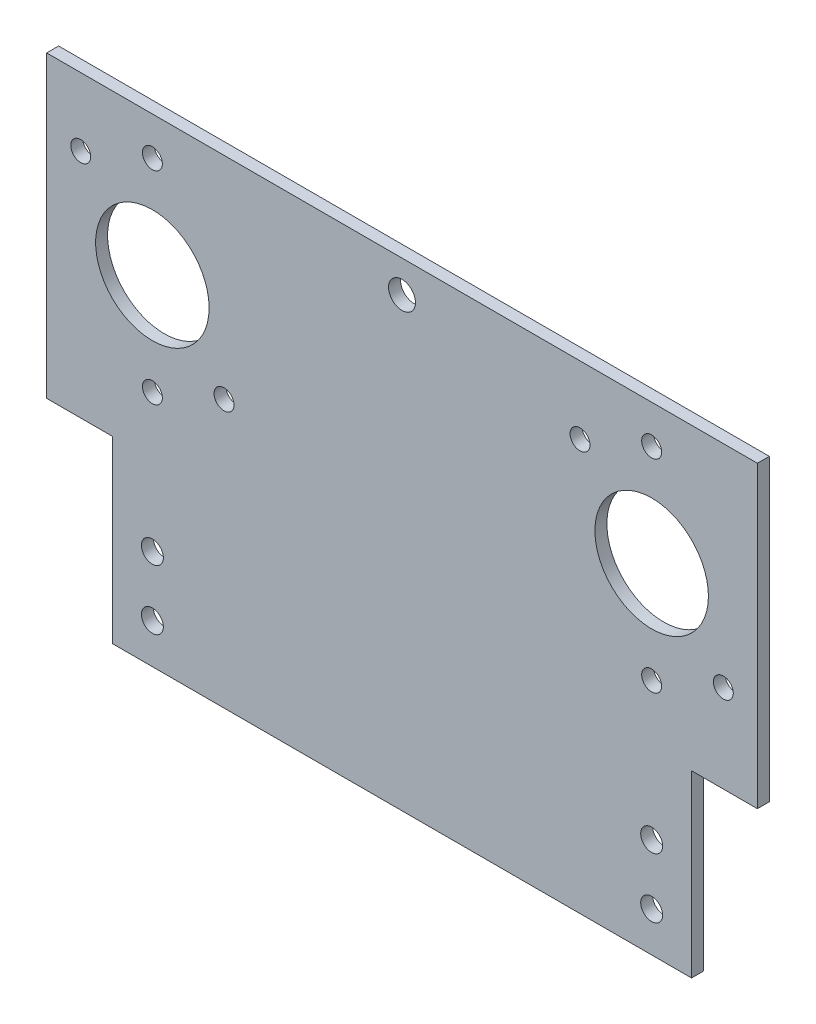
ISO-10303-21;
HEADER;
FILE_DESCRIPTION(('STEP AP214'),'2;1');
FILE_NAME('part.step','',(''),(''),'','','');
FILE_SCHEMA(('AUTOMOTIVE_DESIGN { 1 0 10303 214 1 1 1 1 }'));
ENDSEC;
DATA;
#1=APPLICATION_CONTEXT('core data for automotive mechanical design processes');
#2=APPLICATION_PROTOCOL_DEFINITION('international standard','automotive_design',2000,#1);
#3=PRODUCT_CONTEXT('',#1,'mechanical');
#4=PRODUCT('Part','Part','',(#3));
#5=PRODUCT_RELATED_PRODUCT_CATEGORY('part','',(#4));
#6=PRODUCT_DEFINITION_FORMATION('','',#4);
#7=PRODUCT_DEFINITION_CONTEXT('part definition',#1,'design');
#8=PRODUCT_DEFINITION('design','',#6,#7);
#9=PRODUCT_DEFINITION_SHAPE('','',#8);
#10=(LENGTH_UNIT() NAMED_UNIT(*) SI_UNIT(.MILLI.,.METRE.));
#11=(NAMED_UNIT(*) PLANE_ANGLE_UNIT() SI_UNIT($,.RADIAN.));
#12=(NAMED_UNIT(*) SI_UNIT($,.STERADIAN.) SOLID_ANGLE_UNIT());
#13=UNCERTAINTY_MEASURE_WITH_UNIT(LENGTH_MEASURE(1.E-05),#10,'distance_accuracy_value','');
#14=(GEOMETRIC_REPRESENTATION_CONTEXT(3) GLOBAL_UNCERTAINTY_ASSIGNED_CONTEXT((#13)) GLOBAL_UNIT_ASSIGNED_CONTEXT((#10,
#11,#12)) REPRESENTATION_CONTEXT('',''));
#15=CARTESIAN_POINT('',(0.,0.,0.));
#16=DIRECTION('',(0.,0.,1.));
#17=DIRECTION('',(1.,0.,0.));
#18=AXIS2_PLACEMENT_3D('',#15,#16,#17);
#19=CARTESIAN_POINT('',(0.,-120.,3.));
#20=DIRECTION('',(0.,1.,0.));
#21=DIRECTION('',(0.,0.,1.));
#22=AXIS2_PLACEMENT_3D('',#19,#20,#21);
#23=PLANE('',#22);
#24=DIRECTION('',(1.,0.,0.));
#25=VECTOR('',#24,1.);
#26=CARTESIAN_POINT('',(0.,-120.,0.));
#27=LINE('',#26,#25);
#28=CARTESIAN_POINT('',(16.5,-120.,0.));
#29=VERTEX_POINT('',#28);
#30=CARTESIAN_POINT('',(161.66,-120.,0.));
#31=VERTEX_POINT('',#30);
#32=EDGE_CURVE('E123',#29,#31,#27,.T.);
#33=ORIENTED_EDGE('',*,*,#32,.T.);
#34=DIRECTION('',(0.,0.,1.));
#35=VECTOR('',#34,1.);
#36=CARTESIAN_POINT('',(161.66,-120.,0.));
#37=LINE('',#36,#35);
#38=CARTESIAN_POINT('',(161.66,-120.,3.));
#39=VERTEX_POINT('',#38);
#40=EDGE_CURVE('E172',#31,#39,#37,.T.);
#41=ORIENTED_EDGE('',*,*,#40,.T.);
#42=DIRECTION('',(1.,0.,0.));
#43=VECTOR('',#42,1.);
#44=CARTESIAN_POINT('',(0.,-120.,3.));
#45=LINE('',#44,#43);
#46=CARTESIAN_POINT('',(16.5,-120.,3.));
#47=VERTEX_POINT('',#46);
#48=EDGE_CURVE('E141',#47,#39,#45,.T.);
#49=ORIENTED_EDGE('',*,*,#48,.F.);
#50=DIRECTION('',(0.,0.,1.));
#51=VECTOR('',#50,1.);
#52=CARTESIAN_POINT('',(16.5,-120.,0.));
#53=LINE('',#52,#51);
#54=EDGE_CURVE('E175',#29,#47,#53,.T.);
#55=ORIENTED_EDGE('',*,*,#54,.F.);
#56=EDGE_LOOP('',(#33,#41,#49,#55));
#57=FACE_BOUND('',#56,.T.);
#58=ADVANCED_FACE('F39',(#57),#23,.F.);
#59=CARTESIAN_POINT('',(178.16,0.,3.));
#60=DIRECTION('',(-1.,0.,0.));
#61=DIRECTION('',(0.,-1.,0.));
#62=AXIS2_PLACEMENT_3D('',#59,#60,#61);
#63=PLANE('',#62);
#64=DIRECTION('',(0.,0.,1.));
#65=VECTOR('',#64,1.);
#66=CARTESIAN_POINT('',(178.16,-75.,0.));
#67=LINE('',#66,#65);
#68=CARTESIAN_POINT('',(178.16,-75.,0.));
#69=VERTEX_POINT('',#68);
#70=CARTESIAN_POINT('',(178.16,-75.,3.));
#71=VERTEX_POINT('',#70);
#72=EDGE_CURVE('E110',#69,#71,#67,.T.);
#73=ORIENTED_EDGE('',*,*,#72,.F.);
#74=DIRECTION('',(0.,1.,0.));
#75=VECTOR('',#74,1.);
#76=CARTESIAN_POINT('',(178.16,0.,0.));
#77=LINE('',#76,#75);
#78=CARTESIAN_POINT('',(178.16,0.,0.));
#79=VERTEX_POINT('',#78);
#80=EDGE_CURVE('E117',#69,#79,#77,.T.);
#81=ORIENTED_EDGE('',*,*,#80,.T.);
#82=DIRECTION('',(0.,0.,-1.));
#83=VECTOR('',#82,1.);
#84=CARTESIAN_POINT('',(178.16,0.,3.));
#85=LINE('',#84,#83);
#86=CARTESIAN_POINT('',(178.16,0.,3.));
#87=VERTEX_POINT('',#86);
#88=EDGE_CURVE('E11',#87,#79,#85,.T.);
#89=ORIENTED_EDGE('',*,*,#88,.F.);
#90=DIRECTION('',(0.,1.,0.));
#91=VECTOR('',#90,1.);
#92=CARTESIAN_POINT('',(178.16,0.,3.));
#93=LINE('',#92,#91);
#94=EDGE_CURVE('E118',#71,#87,#93,.T.);
#95=ORIENTED_EDGE('',*,*,#94,.F.);
#96=EDGE_LOOP('',(#73,#81,#89,#95));
#97=FACE_BOUND('',#96,.T.);
#98=ADVANCED_FACE('F116',(#97),#63,.F.);
#99=CARTESIAN_POINT('',(0.,0.,3.));
#100=DIRECTION('',(1.,0.,0.));
#101=DIRECTION('',(0.,1.,0.));
#102=AXIS2_PLACEMENT_3D('',#99,#100,#101);
#103=PLANE('',#102);
#104=DIRECTION('',(0.,-1.,0.));
#105=VECTOR('',#104,1.);
#106=CARTESIAN_POINT('',(0.,0.,0.));
#107=LINE('',#106,#105);
#108=CARTESIAN_POINT('',(0.,0.,0.));
#109=VERTEX_POINT('',#108);
#110=CARTESIAN_POINT('',(0.,-75.,0.));
#111=VERTEX_POINT('',#110);
#112=EDGE_CURVE('E129',#109,#111,#107,.T.);
#113=ORIENTED_EDGE('',*,*,#112,.T.);
#114=DIRECTION('',(0.,0.,1.));
#115=VECTOR('',#114,1.);
#116=CARTESIAN_POINT('',(0.,-75.,0.));
#117=LINE('',#116,#115);
#118=CARTESIAN_POINT('',(0.,-75.,3.));
#119=VERTEX_POINT('',#118);
#120=EDGE_CURVE('E190',#111,#119,#117,.T.);
#121=ORIENTED_EDGE('',*,*,#120,.T.);
#122=DIRECTION('',(0.,-1.,0.));
#123=VECTOR('',#122,1.);
#124=CARTESIAN_POINT('',(0.,0.,3.));
#125=LINE('',#124,#123);
#126=CARTESIAN_POINT('',(0.,0.,3.));
#127=VERTEX_POINT('',#126);
#128=EDGE_CURVE('E130',#127,#119,#125,.T.);
#129=ORIENTED_EDGE('',*,*,#128,.F.);
#130=DIRECTION('',(0.,0.,-1.));
#131=VECTOR('',#130,1.);
#132=CARTESIAN_POINT('',(0.,0.,3.));
#133=LINE('',#132,#131);
#134=EDGE_CURVE('E50',#127,#109,#133,.T.);
#135=ORIENTED_EDGE('',*,*,#134,.T.);
#136=EDGE_LOOP('',(#113,#121,#129,#135));
#137=FACE_BOUND('',#136,.T.);
#138=ADVANCED_FACE('F41',(#137),#103,.F.);
#139=CARTESIAN_POINT('',(0.,0.,3.));
#140=DIRECTION('',(0.,-1.,0.));
#141=DIRECTION('',(0.,0.,-1.));
#142=AXIS2_PLACEMENT_3D('',#139,#140,#141);
#143=PLANE('',#142);
#144=DIRECTION('',(-1.,0.,0.));
#145=VECTOR('',#144,1.);
#146=CARTESIAN_POINT('',(0.,0.,0.));
#147=LINE('',#146,#145);
#148=EDGE_CURVE('E121',#79,#109,#147,.T.);
#149=ORIENTED_EDGE('',*,*,#148,.T.);
#150=ORIENTED_EDGE('',*,*,#134,.F.);
#151=DIRECTION('',(-1.,0.,0.));
#152=VECTOR('',#151,1.);
#153=CARTESIAN_POINT('',(0.,0.,3.));
#154=LINE('',#153,#152);
#155=EDGE_CURVE('E134',#87,#127,#154,.T.);
#156=ORIENTED_EDGE('',*,*,#155,.F.);
#157=ORIENTED_EDGE('',*,*,#88,.T.);
#158=EDGE_LOOP('',(#149,#150,#156,#157));
#159=FACE_BOUND('',#158,.T.);
#160=ADVANCED_FACE('F301',(#159),#143,.F.);
#161=CARTESIAN_POINT('',(0.,0.,3.));
#162=DIRECTION('',(0.,0.,1.));
#163=DIRECTION('',(1.,0.,0.));
#164=AXIS2_PLACEMENT_3D('',#161,#162,#163);
#165=PLANE('',#164);
#166=DIRECTION('',(-1.,0.,0.));
#167=VECTOR('',#166,1.);
#168=CARTESIAN_POINT('',(178.16,-75.,3.));
#169=LINE('',#168,#167);
#170=CARTESIAN_POINT('',(161.66,-75.,3.));
#171=VERTEX_POINT('',#170);
#172=EDGE_CURVE('E192',#71,#171,#169,.T.);
#173=ORIENTED_EDGE('',*,*,#172,.F.);
#174=ORIENTED_EDGE('',*,*,#94,.T.);
#175=ORIENTED_EDGE('',*,*,#155,.T.);
#176=ORIENTED_EDGE('',*,*,#128,.T.);
#177=DIRECTION('',(-1.,0.,0.));
#178=VECTOR('',#177,1.);
#179=CARTESIAN_POINT('',(0.,-75.,3.));
#180=LINE('',#179,#178);
#181=CARTESIAN_POINT('',(16.5,-75.,3.));
#182=VERTEX_POINT('',#181);
#183=EDGE_CURVE('E186',#182,#119,#180,.T.);
#184=ORIENTED_EDGE('',*,*,#183,.F.);
#185=DIRECTION('',(0.,1.,0.));
#186=VECTOR('',#185,1.);
#187=CARTESIAN_POINT('',(16.5,-120.,3.));
#188=LINE('',#187,#186);
#189=EDGE_CURVE('E166',#47,#182,#188,.T.);
#190=ORIENTED_EDGE('',*,*,#189,.F.);
#191=ORIENTED_EDGE('',*,*,#48,.T.);
#192=DIRECTION('',(0.,-1.,0.));
#193=VECTOR('',#192,1.);
#194=CARTESIAN_POINT('',(161.66,-120.,3.));
#195=LINE('',#194,#193);
#196=EDGE_CURVE('E115',#171,#39,#195,.T.);
#197=ORIENTED_EDGE('',*,*,#196,.F.);
#198=EDGE_LOOP('',(#173,#174,#175,#176,#184,#190,#191,#197));
#199=FACE_BOUND('',#198,.T.);
#200=CARTESIAN_POINT('',(169.620512242138,-52.9605122421383,3.));
#201=DIRECTION('',(0.,0.,1.));
#202=DIRECTION('',(1.,0.,0.));
#203=AXIS2_PLACEMENT_3D('',#200,#201,#202);
#204=CIRCLE('',#203,2.5);
#205=CARTESIAN_POINT('',(172.120512242138,-52.9605122421383,3.));
#206=VERTEX_POINT('',#205);
#207=EDGE_CURVE('E219',#206,#206,#204,.T.);
#208=ORIENTED_EDGE('',*,*,#207,.F.);
#209=EDGE_LOOP('',(#208));
#210=FACE_BOUND('',#209,.T.);
#211=CARTESIAN_POINT('',(8.53948775786157,-17.0394877578617,3.));
#212=DIRECTION('',(0.,0.,1.));
#213=DIRECTION('',(1.,0.,0.));
#214=AXIS2_PLACEMENT_3D('',#211,#212,#213);
#215=CIRCLE('',#214,2.5);
#216=CARTESIAN_POINT('',(11.0394877578616,-17.0394877578617,3.));
#217=VERTEX_POINT('',#216);
#218=EDGE_CURVE('E215',#217,#217,#215,.T.);
#219=ORIENTED_EDGE('',*,*,#218,.F.);
#220=EDGE_LOOP('',(#219));
#221=FACE_BOUND('',#220,.T.);
#222=CARTESIAN_POINT('',(26.4999999999999,-9.6,3.));
#223=DIRECTION('',(0.,0.,1.));
#224=DIRECTION('',(1.,0.,0.));
#225=AXIS2_PLACEMENT_3D('',#222,#223,#224);
#226=CIRCLE('',#225,2.5);
#227=CARTESIAN_POINT('',(28.9999999999999,-9.6,3.));
#228=VERTEX_POINT('',#227);
#229=EDGE_CURVE('E233',#228,#228,#226,.T.);
#230=ORIENTED_EDGE('',*,*,#229,.F.);
#231=EDGE_LOOP('',(#230));
#232=FACE_BOUND('',#231,.T.);
#233=CARTESIAN_POINT('',(44.4605122421382,-52.9605122421383,3.));
#234=DIRECTION('',(0.,0.,1.));
#235=DIRECTION('',(1.,0.,0.));
#236=AXIS2_PLACEMENT_3D('',#233,#234,#235);
#237=CIRCLE('',#236,2.5);
#238=CARTESIAN_POINT('',(46.9605122421382,-52.9605122421383,3.));
#239=VERTEX_POINT('',#238);
#240=EDGE_CURVE('E222',#239,#239,#237,.T.);
#241=ORIENTED_EDGE('',*,*,#240,.F.);
#242=EDGE_LOOP('',(#241));
#243=FACE_BOUND('',#242,.T.);
#244=CARTESIAN_POINT('',(151.66,-60.4,3.));
#245=DIRECTION('',(0.,0.,1.));
#246=DIRECTION('',(1.,0.,0.));
#247=AXIS2_PLACEMENT_3D('',#244,#245,#246);
#248=CIRCLE('',#247,2.5);
#249=CARTESIAN_POINT('',(154.16,-60.4,3.));
#250=VERTEX_POINT('',#249);
#251=EDGE_CURVE('E200',#250,#250,#248,.T.);
#252=ORIENTED_EDGE('',*,*,#251,.F.);
#253=EDGE_LOOP('',(#252));
#254=FACE_BOUND('',#253,.T.);
#255=CARTESIAN_POINT('',(133.699487757862,-17.0394877578617,3.));
#256=DIRECTION('',(0.,0.,1.));
#257=DIRECTION('',(1.,0.,0.));
#258=AXIS2_PLACEMENT_3D('',#255,#256,#257);
#259=CIRCLE('',#258,2.5);
#260=CARTESIAN_POINT('',(136.199487757862,-17.0394877578617,3.));
#261=VERTEX_POINT('',#260);
#262=EDGE_CURVE('E202',#261,#261,#259,.T.);
#263=ORIENTED_EDGE('',*,*,#262,.F.);
#264=EDGE_LOOP('',(#263));
#265=FACE_BOUND('',#264,.T.);
#266=CARTESIAN_POINT('',(151.66,-9.60000000000001,3.));
#267=DIRECTION('',(0.,0.,1.));
#268=DIRECTION('',(1.,0.,0.));
#269=AXIS2_PLACEMENT_3D('',#266,#267,#268);
#270=CIRCLE('',#269,2.5);
#271=CARTESIAN_POINT('',(154.16,-9.60000000000001,3.));
#272=VERTEX_POINT('',#271);
#273=EDGE_CURVE('E178',#272,#272,#270,.T.);
#274=ORIENTED_EDGE('',*,*,#273,.F.);
#275=EDGE_LOOP('',(#274));
#276=FACE_BOUND('',#275,.T.);
#277=CARTESIAN_POINT('',(26.4999999999999,-60.4,3.));
#278=DIRECTION('',(0.,0.,1.));
#279=DIRECTION('',(1.,0.,0.));
#280=AXIS2_PLACEMENT_3D('',#277,#278,#279);
#281=CIRCLE('',#280,2.5);
#282=CARTESIAN_POINT('',(28.9999999999999,-60.4,3.));
#283=VERTEX_POINT('',#282);
#284=EDGE_CURVE('E227',#283,#283,#281,.T.);
#285=ORIENTED_EDGE('',*,*,#284,.F.);
#286=EDGE_LOOP('',(#285));
#287=FACE_BOUND('',#286,.T.);
#288=CARTESIAN_POINT('',(89.08,-8.00000000000002,3.));
#289=DIRECTION('',(0.,0.,1.));
#290=DIRECTION('',(1.,0.,0.));
#291=AXIS2_PLACEMENT_3D('',#288,#289,#290);
#292=CIRCLE('',#291,3.375);
#293=CARTESIAN_POINT('',(92.455,-8.00000000000002,3.));
#294=VERTEX_POINT('',#293);
#295=EDGE_CURVE('E259',#294,#294,#292,.T.);
#296=ORIENTED_EDGE('',*,*,#295,.F.);
#297=EDGE_LOOP('',(#296));
#298=FACE_BOUND('',#297,.T.);
#299=CARTESIAN_POINT('',(151.66,-110.,3.));
#300=DIRECTION('',(0.,0.,1.));
#301=DIRECTION('',(1.,0.,0.));
#302=AXIS2_PLACEMENT_3D('',#299,#300,#301);
#303=CIRCLE('',#302,2.75000000000001);
#304=CARTESIAN_POINT('',(154.41,-110.,3.));
#305=VERTEX_POINT('',#304);
#306=EDGE_CURVE('E251',#305,#305,#303,.T.);
#307=ORIENTED_EDGE('',*,*,#306,.F.);
#308=EDGE_LOOP('',(#307));
#309=FACE_BOUND('',#308,.T.);
#310=CARTESIAN_POINT('',(26.5,-110.,3.));
#311=DIRECTION('',(0.,0.,1.));
#312=DIRECTION('',(1.,0.,0.));
#313=AXIS2_PLACEMENT_3D('',#310,#311,#312);
#314=CIRCLE('',#313,2.75);
#315=CARTESIAN_POINT('',(29.25,-110.,3.));
#316=VERTEX_POINT('',#315);
#317=EDGE_CURVE('E267',#316,#316,#314,.T.);
#318=ORIENTED_EDGE('',*,*,#317,.F.);
#319=EDGE_LOOP('',(#318));
#320=FACE_BOUND('',#319,.T.);
#321=CARTESIAN_POINT('',(151.66,-35.,3.));
#322=DIRECTION('',(0.,0.,1.));
#323=DIRECTION('',(1.,0.,0.));
#324=AXIS2_PLACEMENT_3D('',#321,#322,#323);
#325=CIRCLE('',#324,14.225);
#326=CARTESIAN_POINT('',(165.885,-35.,3.));
#327=VERTEX_POINT('',#326);
#328=EDGE_CURVE('E154',#327,#327,#325,.T.);
#329=ORIENTED_EDGE('',*,*,#328,.F.);
#330=EDGE_LOOP('',(#329));
#331=FACE_BOUND('',#330,.T.);
#332=CARTESIAN_POINT('',(26.5,-95.,3.));
#333=DIRECTION('',(0.,0.,1.));
#334=DIRECTION('',(1.,0.,0.));
#335=AXIS2_PLACEMENT_3D('',#332,#333,#334);
#336=CIRCLE('',#335,2.75);
#337=CARTESIAN_POINT('',(29.25,-95.,3.));
#338=VERTEX_POINT('',#337);
#339=EDGE_CURVE('E245',#338,#338,#336,.T.);
#340=ORIENTED_EDGE('',*,*,#339,.F.);
#341=EDGE_LOOP('',(#340));
#342=FACE_BOUND('',#341,.T.);
#343=CARTESIAN_POINT('',(151.66,-95.,3.));
#344=DIRECTION('',(0.,0.,1.));
#345=DIRECTION('',(1.,0.,0.));
#346=AXIS2_PLACEMENT_3D('',#343,#344,#345);
#347=CIRCLE('',#346,2.75000000000001);
#348=CARTESIAN_POINT('',(154.41,-95.,3.));
#349=VERTEX_POINT('',#348);
#350=EDGE_CURVE('E248',#349,#349,#347,.T.);
#351=ORIENTED_EDGE('',*,*,#350,.F.);
#352=EDGE_LOOP('',(#351));
#353=FACE_BOUND('',#352,.T.);
#354=CARTESIAN_POINT('',(26.5,-35.,3.));
#355=DIRECTION('',(0.,0.,1.));
#356=DIRECTION('',(1.,0.,0.));
#357=AXIS2_PLACEMENT_3D('',#354,#355,#356);
#358=CIRCLE('',#357,14.225);
#359=CARTESIAN_POINT('',(40.725,-35.,3.));
#360=VERTEX_POINT('',#359);
#361=EDGE_CURVE('E148',#360,#360,#358,.T.);
#362=ORIENTED_EDGE('',*,*,#361,.F.);
#363=EDGE_LOOP('',(#362));
#364=FACE_BOUND('',#363,.T.);
#365=ADVANCED_FACE('F165',(#199,#210,#221,#232,#243,#254,#265,#276,#287,#298,#309,#320,#331,
#342,#353,#364),#165,.T.);
#366=CARTESIAN_POINT('',(0.,0.,0.));
#367=DIRECTION('',(0.,0.,1.));
#368=DIRECTION('',(1.,0.,0.));
#369=AXIS2_PLACEMENT_3D('',#366,#367,#368);
#370=PLANE('',#369);
#371=CARTESIAN_POINT('',(169.620512242138,-52.9605122421383,0.));
#372=DIRECTION('',(0.,0.,1.));
#373=DIRECTION('',(1.,0.,0.));
#374=AXIS2_PLACEMENT_3D('',#371,#372,#373);
#375=CIRCLE('',#374,2.5);
#376=CARTESIAN_POINT('',(172.120512242138,-52.9605122421383,0.));
#377=VERTEX_POINT('',#376);
#378=EDGE_CURVE('E197',#377,#377,#375,.T.);
#379=ORIENTED_EDGE('',*,*,#378,.T.);
#380=EDGE_LOOP('',(#379));
#381=FACE_BOUND('',#380,.T.);
#382=CARTESIAN_POINT('',(8.53948775786157,-17.0394877578617,0.));
#383=DIRECTION('',(0.,0.,1.));
#384=DIRECTION('',(1.,0.,0.));
#385=AXIS2_PLACEMENT_3D('',#382,#383,#384);
#386=CIRCLE('',#385,2.5);
#387=CARTESIAN_POINT('',(11.0394877578616,-17.0394877578617,0.));
#388=VERTEX_POINT('',#387);
#389=EDGE_CURVE('E218',#388,#388,#386,.T.);
#390=ORIENTED_EDGE('',*,*,#389,.T.);
#391=EDGE_LOOP('',(#390));
#392=FACE_BOUND('',#391,.T.);
#393=CARTESIAN_POINT('',(26.4999999999999,-9.6,0.));
#394=DIRECTION('',(0.,0.,1.));
#395=DIRECTION('',(1.,0.,0.));
#396=AXIS2_PLACEMENT_3D('',#393,#394,#395);
#397=CIRCLE('',#396,2.5);
#398=CARTESIAN_POINT('',(28.9999999999999,-9.6,0.));
#399=VERTEX_POINT('',#398);
#400=EDGE_CURVE('E214',#399,#399,#397,.T.);
#401=ORIENTED_EDGE('',*,*,#400,.T.);
#402=EDGE_LOOP('',(#401));
#403=FACE_BOUND('',#402,.T.);
#404=CARTESIAN_POINT('',(44.4605122421382,-52.9605122421383,0.));
#405=DIRECTION('',(0.,0.,1.));
#406=DIRECTION('',(1.,0.,0.));
#407=AXIS2_PLACEMENT_3D('',#404,#405,#406);
#408=CIRCLE('',#407,2.5);
#409=CARTESIAN_POINT('',(46.9605122421382,-52.9605122421383,0.));
#410=VERTEX_POINT('',#409);
#411=EDGE_CURVE('E226',#410,#410,#408,.T.);
#412=ORIENTED_EDGE('',*,*,#411,.T.);
#413=EDGE_LOOP('',(#412));
#414=FACE_BOUND('',#413,.T.);
#415=CARTESIAN_POINT('',(151.66,-60.4,0.));
#416=DIRECTION('',(0.,0.,1.));
#417=DIRECTION('',(1.,0.,0.));
#418=AXIS2_PLACEMENT_3D('',#415,#416,#417);
#419=CIRCLE('',#418,2.5);
#420=CARTESIAN_POINT('',(154.16,-60.4,0.));
#421=VERTEX_POINT('',#420);
#422=EDGE_CURVE('E203',#421,#421,#419,.T.);
#423=ORIENTED_EDGE('',*,*,#422,.T.);
#424=EDGE_LOOP('',(#423));
#425=FACE_BOUND('',#424,.T.);
#426=CARTESIAN_POINT('',(133.699487757862,-17.0394877578617,0.));
#427=DIRECTION('',(0.,0.,1.));
#428=DIRECTION('',(1.,0.,0.));
#429=AXIS2_PLACEMENT_3D('',#426,#427,#428);
#430=CIRCLE('',#429,2.5);
#431=CARTESIAN_POINT('',(136.199487757862,-17.0394877578617,0.));
#432=VERTEX_POINT('',#431);
#433=EDGE_CURVE('E210',#432,#432,#430,.T.);
#434=ORIENTED_EDGE('',*,*,#433,.T.);
#435=EDGE_LOOP('',(#434));
#436=FACE_BOUND('',#435,.T.);
#437=CARTESIAN_POINT('',(151.66,-9.60000000000001,0.));
#438=DIRECTION('',(0.,0.,1.));
#439=DIRECTION('',(1.,0.,0.));
#440=AXIS2_PLACEMENT_3D('',#437,#438,#439);
#441=CIRCLE('',#440,2.5);
#442=CARTESIAN_POINT('',(154.16,-9.60000000000001,0.));
#443=VERTEX_POINT('',#442);
#444=EDGE_CURVE('E174',#443,#443,#441,.T.);
#445=ORIENTED_EDGE('',*,*,#444,.T.);
#446=EDGE_LOOP('',(#445));
#447=FACE_BOUND('',#446,.T.);
#448=CARTESIAN_POINT('',(26.4999999999999,-60.4,0.));
#449=DIRECTION('',(0.,0.,1.));
#450=DIRECTION('',(1.,0.,0.));
#451=AXIS2_PLACEMENT_3D('',#448,#449,#450);
#452=CIRCLE('',#451,2.5);
#453=CARTESIAN_POINT('',(28.9999999999999,-60.4,0.));
#454=VERTEX_POINT('',#453);
#455=EDGE_CURVE('E236',#454,#454,#452,.T.);
#456=ORIENTED_EDGE('',*,*,#455,.T.);
#457=EDGE_LOOP('',(#456));
#458=FACE_BOUND('',#457,.T.);
#459=CARTESIAN_POINT('',(89.08,-8.00000000000002,0.));
#460=DIRECTION('',(0.,0.,1.));
#461=DIRECTION('',(1.,0.,0.));
#462=AXIS2_PLACEMENT_3D('',#459,#460,#461);
#463=CIRCLE('',#462,3.375);
#464=CARTESIAN_POINT('',(92.455,-8.00000000000002,0.));
#465=VERTEX_POINT('',#464);
#466=EDGE_CURVE('E244',#465,#465,#463,.T.);
#467=ORIENTED_EDGE('',*,*,#466,.T.);
#468=EDGE_LOOP('',(#467));
#469=FACE_BOUND('',#468,.T.);
#470=CARTESIAN_POINT('',(151.66,-110.,0.));
#471=DIRECTION('',(0.,0.,1.));
#472=DIRECTION('',(1.,0.,0.));
#473=AXIS2_PLACEMENT_3D('',#470,#471,#472);
#474=CIRCLE('',#473,2.75000000000001);
#475=CARTESIAN_POINT('',(154.41,-110.,0.));
#476=VERTEX_POINT('',#475);
#477=EDGE_CURVE('E260',#476,#476,#474,.T.);
#478=ORIENTED_EDGE('',*,*,#477,.T.);
#479=EDGE_LOOP('',(#478));
#480=FACE_BOUND('',#479,.T.);
#481=CARTESIAN_POINT('',(26.5,-110.,0.));
#482=DIRECTION('',(0.,0.,1.));
#483=DIRECTION('',(1.,0.,0.));
#484=AXIS2_PLACEMENT_3D('',#481,#482,#483);
#485=CIRCLE('',#484,2.75);
#486=CARTESIAN_POINT('',(29.25,-110.,0.));
#487=VERTEX_POINT('',#486);
#488=EDGE_CURVE('E160',#487,#487,#485,.T.);
#489=ORIENTED_EDGE('',*,*,#488,.T.);
#490=EDGE_LOOP('',(#489));
#491=FACE_BOUND('',#490,.T.);
#492=CARTESIAN_POINT('',(151.66,-35.,0.));
#493=DIRECTION('',(0.,0.,1.));
#494=DIRECTION('',(1.,0.,0.));
#495=AXIS2_PLACEMENT_3D('',#492,#493,#494);
#496=CIRCLE('',#495,14.225);
#497=CARTESIAN_POINT('',(165.885,-35.,0.));
#498=VERTEX_POINT('',#497);
#499=EDGE_CURVE('E270',#498,#498,#496,.T.);
#500=ORIENTED_EDGE('',*,*,#499,.T.);
#501=EDGE_LOOP('',(#500));
#502=FACE_BOUND('',#501,.T.);
#503=CARTESIAN_POINT('',(26.5,-95.,0.));
#504=DIRECTION('',(0.,0.,1.));
#505=DIRECTION('',(1.,0.,0.));
#506=AXIS2_PLACEMENT_3D('',#503,#504,#505);
#507=CIRCLE('',#506,2.75);
#508=CARTESIAN_POINT('',(29.25,-95.,0.));
#509=VERTEX_POINT('',#508);
#510=EDGE_CURVE('E246',#509,#509,#507,.T.);
#511=ORIENTED_EDGE('',*,*,#510,.T.);
#512=EDGE_LOOP('',(#511));
#513=FACE_BOUND('',#512,.T.);
#514=CARTESIAN_POINT('',(151.66,-95.,0.));
#515=DIRECTION('',(0.,0.,1.));
#516=DIRECTION('',(1.,0.,0.));
#517=AXIS2_PLACEMENT_3D('',#514,#515,#516);
#518=CIRCLE('',#517,2.75000000000001);
#519=CARTESIAN_POINT('',(154.41,-95.,0.));
#520=VERTEX_POINT('',#519);
#521=EDGE_CURVE('E237',#520,#520,#518,.T.);
#522=ORIENTED_EDGE('',*,*,#521,.T.);
#523=EDGE_LOOP('',(#522));
#524=FACE_BOUND('',#523,.T.);
#525=CARTESIAN_POINT('',(26.5,-35.,0.));
#526=DIRECTION('',(0.,0.,1.));
#527=DIRECTION('',(1.,0.,0.));
#528=AXIS2_PLACEMENT_3D('',#525,#526,#527);
#529=CIRCLE('',#528,14.225);
#530=CARTESIAN_POINT('',(40.725,-35.,0.));
#531=VERTEX_POINT('',#530);
#532=EDGE_CURVE('E146',#531,#531,#529,.T.);
#533=ORIENTED_EDGE('',*,*,#532,.T.);
#534=EDGE_LOOP('',(#533));
#535=FACE_BOUND('',#534,.T.);
#536=DIRECTION('',(-1.,0.,0.));
#537=VECTOR('',#536,1.);
#538=CARTESIAN_POINT('',(178.16,-75.,0.));
#539=LINE('',#538,#537);
#540=CARTESIAN_POINT('',(161.66,-75.,0.));
#541=VERTEX_POINT('',#540);
#542=EDGE_CURVE('E101',#69,#541,#539,.T.);
#543=ORIENTED_EDGE('',*,*,#542,.T.);
#544=DIRECTION('',(0.,-1.,0.));
#545=VECTOR('',#544,1.);
#546=CARTESIAN_POINT('',(161.66,-120.,0.));
#547=LINE('',#546,#545);
#548=EDGE_CURVE('E53',#541,#31,#547,.T.);
#549=ORIENTED_EDGE('',*,*,#548,.T.);
#550=ORIENTED_EDGE('',*,*,#32,.F.);
#551=DIRECTION('',(0.,1.,0.));
#552=VECTOR('',#551,1.);
#553=CARTESIAN_POINT('',(16.5,-120.,0.));
#554=LINE('',#553,#552);
#555=CARTESIAN_POINT('',(16.5,-75.,0.));
#556=VERTEX_POINT('',#555);
#557=EDGE_CURVE('E191',#29,#556,#554,.T.);
#558=ORIENTED_EDGE('',*,*,#557,.T.);
#559=DIRECTION('',(-1.,0.,0.));
#560=VECTOR('',#559,1.);
#561=CARTESIAN_POINT('',(0.,-75.,0.));
#562=LINE('',#561,#560);
#563=EDGE_CURVE('E65',#556,#111,#562,.T.);
#564=ORIENTED_EDGE('',*,*,#563,.T.);
#565=ORIENTED_EDGE('',*,*,#112,.F.);
#566=ORIENTED_EDGE('',*,*,#148,.F.);
#567=ORIENTED_EDGE('',*,*,#80,.F.);
#568=EDGE_LOOP('',(#543,#549,#550,#558,#564,#565,#566,#567));
#569=FACE_BOUND('',#568,.T.);
#570=ADVANCED_FACE('F125',(#381,#392,#403,#414,#425,#436,#447,#458,#469,#480,#491,#502,#513,
#524,#535,#569),#370,.F.);
#571=CARTESIAN_POINT('',(26.5,-35.,0.));
#572=DIRECTION('',(0.,0.,1.));
#573=DIRECTION('',(1.,0.,0.));
#574=AXIS2_PLACEMENT_3D('',#571,#572,#573);
#575=CYLINDRICAL_SURFACE('',#574,14.225);
#576=ORIENTED_EDGE('',*,*,#532,.F.);
#577=EDGE_LOOP('',(#576));
#578=FACE_BOUND('',#577,.T.);
#579=ORIENTED_EDGE('',*,*,#361,.T.);
#580=EDGE_LOOP('',(#579));
#581=FACE_BOUND('',#580,.T.);
#582=ADVANCED_FACE('F310',(#578,#581),#575,.F.);
#583=CARTESIAN_POINT('',(151.66,-95.,0.));
#584=DIRECTION('',(0.,0.,1.));
#585=DIRECTION('',(1.,0.,0.));
#586=AXIS2_PLACEMENT_3D('',#583,#584,#585);
#587=CYLINDRICAL_SURFACE('',#586,2.75000000000001);
#588=ORIENTED_EDGE('',*,*,#521,.F.);
#589=EDGE_LOOP('',(#588));
#590=FACE_BOUND('',#589,.T.);
#591=ORIENTED_EDGE('',*,*,#350,.T.);
#592=EDGE_LOOP('',(#591));
#593=FACE_BOUND('',#592,.T.);
#594=ADVANCED_FACE('F311',(#590,#593),#587,.F.);
#595=CARTESIAN_POINT('',(26.5,-95.,0.));
#596=DIRECTION('',(0.,0.,1.));
#597=DIRECTION('',(1.,0.,0.));
#598=AXIS2_PLACEMENT_3D('',#595,#596,#597);
#599=CYLINDRICAL_SURFACE('',#598,2.75);
#600=ORIENTED_EDGE('',*,*,#510,.F.);
#601=EDGE_LOOP('',(#600));
#602=FACE_BOUND('',#601,.T.);
#603=ORIENTED_EDGE('',*,*,#339,.T.);
#604=EDGE_LOOP('',(#603));
#605=FACE_BOUND('',#604,.T.);
#606=ADVANCED_FACE('F289',(#602,#605),#599,.F.);
#607=CARTESIAN_POINT('',(151.66,-35.,0.));
#608=DIRECTION('',(0.,0.,1.));
#609=DIRECTION('',(1.,0.,0.));
#610=AXIS2_PLACEMENT_3D('',#607,#608,#609);
#611=CYLINDRICAL_SURFACE('',#610,14.225);
#612=ORIENTED_EDGE('',*,*,#499,.F.);
#613=EDGE_LOOP('',(#612));
#614=FACE_BOUND('',#613,.T.);
#615=ORIENTED_EDGE('',*,*,#328,.T.);
#616=EDGE_LOOP('',(#615));
#617=FACE_BOUND('',#616,.T.);
#618=ADVANCED_FACE('F283',(#614,#617),#611,.F.);
#619=CARTESIAN_POINT('',(26.5,-110.,0.));
#620=DIRECTION('',(0.,0.,1.));
#621=DIRECTION('',(1.,0.,0.));
#622=AXIS2_PLACEMENT_3D('',#619,#620,#621);
#623=CYLINDRICAL_SURFACE('',#622,2.75);
#624=ORIENTED_EDGE('',*,*,#488,.F.);
#625=EDGE_LOOP('',(#624));
#626=FACE_BOUND('',#625,.T.);
#627=ORIENTED_EDGE('',*,*,#317,.T.);
#628=EDGE_LOOP('',(#627));
#629=FACE_BOUND('',#628,.T.);
#630=ADVANCED_FACE('F277',(#626,#629),#623,.F.);
#631=CARTESIAN_POINT('',(151.66,-110.,0.));
#632=DIRECTION('',(0.,0.,1.));
#633=DIRECTION('',(1.,0.,0.));
#634=AXIS2_PLACEMENT_3D('',#631,#632,#633);
#635=CYLINDRICAL_SURFACE('',#634,2.75000000000001);
#636=ORIENTED_EDGE('',*,*,#477,.F.);
#637=EDGE_LOOP('',(#636));
#638=FACE_BOUND('',#637,.T.);
#639=ORIENTED_EDGE('',*,*,#306,.T.);
#640=EDGE_LOOP('',(#639));
#641=FACE_BOUND('',#640,.T.);
#642=ADVANCED_FACE('F279',(#638,#641),#635,.F.);
#643=CARTESIAN_POINT('',(89.08,-8.00000000000002,0.));
#644=DIRECTION('',(0.,0.,1.));
#645=DIRECTION('',(1.,0.,0.));
#646=AXIS2_PLACEMENT_3D('',#643,#644,#645);
#647=CYLINDRICAL_SURFACE('',#646,3.375);
#648=ORIENTED_EDGE('',*,*,#466,.F.);
#649=EDGE_LOOP('',(#648));
#650=FACE_BOUND('',#649,.T.);
#651=ORIENTED_EDGE('',*,*,#295,.T.);
#652=EDGE_LOOP('',(#651));
#653=FACE_BOUND('',#652,.T.);
#654=ADVANCED_FACE('F290',(#650,#653),#647,.F.);
#655=CARTESIAN_POINT('',(26.4999999999999,-60.4,0.));
#656=DIRECTION('',(0.,0.,1.));
#657=DIRECTION('',(1.,0.,0.));
#658=AXIS2_PLACEMENT_3D('',#655,#656,#657);
#659=CYLINDRICAL_SURFACE('',#658,2.5);
#660=ORIENTED_EDGE('',*,*,#455,.F.);
#661=EDGE_LOOP('',(#660));
#662=FACE_BOUND('',#661,.T.);
#663=ORIENTED_EDGE('',*,*,#284,.T.);
#664=EDGE_LOOP('',(#663));
#665=FACE_BOUND('',#664,.T.);
#666=ADVANCED_FACE('F333',(#662,#665),#659,.F.);
#667=CARTESIAN_POINT('',(151.66,-9.60000000000001,0.));
#668=DIRECTION('',(0.,0.,1.));
#669=DIRECTION('',(1.,0.,0.));
#670=AXIS2_PLACEMENT_3D('',#667,#668,#669);
#671=CYLINDRICAL_SURFACE('',#670,2.5);
#672=ORIENTED_EDGE('',*,*,#444,.F.);
#673=EDGE_LOOP('',(#672));
#674=FACE_BOUND('',#673,.T.);
#675=ORIENTED_EDGE('',*,*,#273,.T.);
#676=EDGE_LOOP('',(#675));
#677=FACE_BOUND('',#676,.T.);
#678=ADVANCED_FACE('F337',(#674,#677),#671,.F.);
#679=CARTESIAN_POINT('',(133.699487757862,-17.0394877578617,0.));
#680=DIRECTION('',(0.,0.,1.));
#681=DIRECTION('',(1.,0.,0.));
#682=AXIS2_PLACEMENT_3D('',#679,#680,#681);
#683=CYLINDRICAL_SURFACE('',#682,2.5);
#684=ORIENTED_EDGE('',*,*,#433,.F.);
#685=EDGE_LOOP('',(#684));
#686=FACE_BOUND('',#685,.T.);
#687=ORIENTED_EDGE('',*,*,#262,.T.);
#688=EDGE_LOOP('',(#687));
#689=FACE_BOUND('',#688,.T.);
#690=ADVANCED_FACE('F359',(#686,#689),#683,.F.);
#691=CARTESIAN_POINT('',(151.66,-60.4,0.));
#692=DIRECTION('',(0.,0.,1.));
#693=DIRECTION('',(1.,0.,0.));
#694=AXIS2_PLACEMENT_3D('',#691,#692,#693);
#695=CYLINDRICAL_SURFACE('',#694,2.5);
#696=ORIENTED_EDGE('',*,*,#422,.F.);
#697=EDGE_LOOP('',(#696));
#698=FACE_BOUND('',#697,.T.);
#699=ORIENTED_EDGE('',*,*,#251,.T.);
#700=EDGE_LOOP('',(#699));
#701=FACE_BOUND('',#700,.T.);
#702=ADVANCED_FACE('F372',(#698,#701),#695,.F.);
#703=CARTESIAN_POINT('',(44.4605122421382,-52.9605122421383,0.));
#704=DIRECTION('',(0.,0.,1.));
#705=DIRECTION('',(1.,0.,0.));
#706=AXIS2_PLACEMENT_3D('',#703,#704,#705);
#707=CYLINDRICAL_SURFACE('',#706,2.5);
#708=ORIENTED_EDGE('',*,*,#411,.F.);
#709=EDGE_LOOP('',(#708));
#710=FACE_BOUND('',#709,.T.);
#711=ORIENTED_EDGE('',*,*,#240,.T.);
#712=EDGE_LOOP('',(#711));
#713=FACE_BOUND('',#712,.T.);
#714=ADVANCED_FACE('F369',(#710,#713),#707,.F.);
#715=CARTESIAN_POINT('',(26.4999999999999,-9.6,0.));
#716=DIRECTION('',(0.,0.,1.));
#717=DIRECTION('',(1.,0.,0.));
#718=AXIS2_PLACEMENT_3D('',#715,#716,#717);
#719=CYLINDRICAL_SURFACE('',#718,2.5);
#720=ORIENTED_EDGE('',*,*,#400,.F.);
#721=EDGE_LOOP('',(#720));
#722=FACE_BOUND('',#721,.T.);
#723=ORIENTED_EDGE('',*,*,#229,.T.);
#724=EDGE_LOOP('',(#723));
#725=FACE_BOUND('',#724,.T.);
#726=ADVANCED_FACE('F366',(#722,#725),#719,.F.);
#727=CARTESIAN_POINT('',(8.53948775786157,-17.0394877578617,0.));
#728=DIRECTION('',(0.,0.,1.));
#729=DIRECTION('',(1.,0.,0.));
#730=AXIS2_PLACEMENT_3D('',#727,#728,#729);
#731=CYLINDRICAL_SURFACE('',#730,2.5);
#732=ORIENTED_EDGE('',*,*,#389,.F.);
#733=EDGE_LOOP('',(#732));
#734=FACE_BOUND('',#733,.T.);
#735=ORIENTED_EDGE('',*,*,#218,.T.);
#736=EDGE_LOOP('',(#735));
#737=FACE_BOUND('',#736,.T.);
#738=ADVANCED_FACE('F367',(#734,#737),#731,.F.);
#739=CARTESIAN_POINT('',(169.620512242138,-52.9605122421383,0.));
#740=DIRECTION('',(0.,0.,1.));
#741=DIRECTION('',(1.,0.,0.));
#742=AXIS2_PLACEMENT_3D('',#739,#740,#741);
#743=CYLINDRICAL_SURFACE('',#742,2.5);
#744=ORIENTED_EDGE('',*,*,#378,.F.);
#745=EDGE_LOOP('',(#744));
#746=FACE_BOUND('',#745,.T.);
#747=ORIENTED_EDGE('',*,*,#207,.T.);
#748=EDGE_LOOP('',(#747));
#749=FACE_BOUND('',#748,.T.);
#750=ADVANCED_FACE('F376',(#746,#749),#743,.F.);
#751=CARTESIAN_POINT('',(0.,-75.,0.));
#752=DIRECTION('',(0.,1.,0.));
#753=DIRECTION('',(0.,0.,1.));
#754=AXIS2_PLACEMENT_3D('',#751,#752,#753);
#755=PLANE('',#754);
#756=ORIENTED_EDGE('',*,*,#183,.T.);
#757=ORIENTED_EDGE('',*,*,#120,.F.);
#758=ORIENTED_EDGE('',*,*,#563,.F.);
#759=DIRECTION('',(0.,0.,1.));
#760=VECTOR('',#759,1.);
#761=CARTESIAN_POINT('',(16.5,-75.,0.));
#762=LINE('',#761,#760);
#763=EDGE_CURVE('E184',#556,#182,#762,.T.);
#764=ORIENTED_EDGE('',*,*,#763,.T.);
#765=EDGE_LOOP('',(#756,#757,#758,#764));
#766=FACE_BOUND('',#765,.T.);
#767=ADVANCED_FACE('F377',(#766),#755,.F.);
#768=CARTESIAN_POINT('',(16.5,-120.,0.));
#769=DIRECTION('',(1.,0.,0.));
#770=DIRECTION('',(0.,0.,-1.));
#771=AXIS2_PLACEMENT_3D('',#768,#769,#770);
#772=PLANE('',#771);
#773=ORIENTED_EDGE('',*,*,#189,.T.);
#774=ORIENTED_EDGE('',*,*,#763,.F.);
#775=ORIENTED_EDGE('',*,*,#557,.F.);
#776=ORIENTED_EDGE('',*,*,#54,.T.);
#777=EDGE_LOOP('',(#773,#774,#775,#776));
#778=FACE_BOUND('',#777,.T.);
#779=ADVANCED_FACE('F393',(#778),#772,.F.);
#780=CARTESIAN_POINT('',(161.66,-120.,0.));
#781=DIRECTION('',(-1.,0.,0.));
#782=DIRECTION('',(0.,0.,1.));
#783=AXIS2_PLACEMENT_3D('',#780,#781,#782);
#784=PLANE('',#783);
#785=ORIENTED_EDGE('',*,*,#196,.T.);
#786=ORIENTED_EDGE('',*,*,#40,.F.);
#787=ORIENTED_EDGE('',*,*,#548,.F.);
#788=DIRECTION('',(0.,0.,1.));
#789=VECTOR('',#788,1.);
#790=CARTESIAN_POINT('',(161.66,-75.,0.));
#791=LINE('',#790,#789);
#792=EDGE_CURVE('E107',#541,#171,#791,.T.);
#793=ORIENTED_EDGE('',*,*,#792,.T.);
#794=EDGE_LOOP('',(#785,#786,#787,#793));
#795=FACE_BOUND('',#794,.T.);
#796=ADVANCED_FACE('F394',(#795),#784,.F.);
#797=CARTESIAN_POINT('',(178.16,-75.,0.));
#798=DIRECTION('',(0.,1.,0.));
#799=DIRECTION('',(0.,0.,1.));
#800=AXIS2_PLACEMENT_3D('',#797,#798,#799);
#801=PLANE('',#800);
#802=ORIENTED_EDGE('',*,*,#172,.T.);
#803=ORIENTED_EDGE('',*,*,#792,.F.);
#804=ORIENTED_EDGE('',*,*,#542,.F.);
#805=ORIENTED_EDGE('',*,*,#72,.T.);
#806=EDGE_LOOP('',(#802,#803,#804,#805));
#807=FACE_BOUND('',#806,.T.);
#808=ADVANCED_FACE('F106',(#807),#801,.F.);
#809=CLOSED_SHELL('',(#58,#98,#138,#160,#365,#570,#582,#594,#606,#618,#630,#642,#654,#666,#678,
#690,#702,#714,#726,#738,#750,#767,#779,#796,#808));
#810=MANIFOLD_SOLID_BREP('B2',#809);
#811=ADVANCED_BREP_SHAPE_REPRESENTATION('',(#18,#810),#14);
#812=SHAPE_DEFINITION_REPRESENTATION(#9,#811);
ENDSEC;
END-ISO-10303-21;
